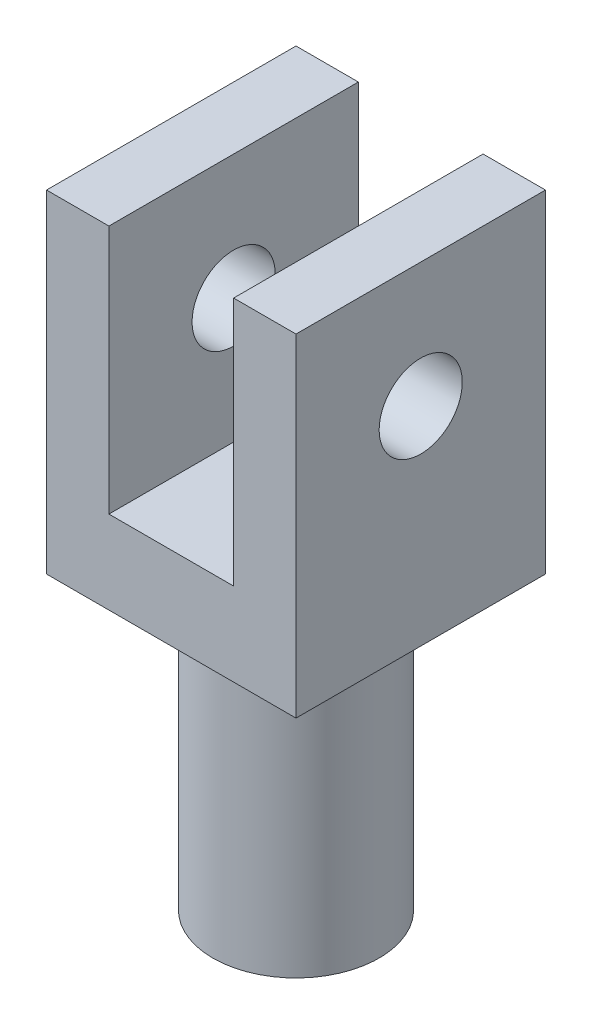
ISO-10303-21;
HEADER;
FILE_DESCRIPTION(('STEP AP214'),'2;1');
FILE_NAME('part.step','',(''),(''),'','','');
FILE_SCHEMA(('AUTOMOTIVE_DESIGN { 1 0 10303 214 1 1 1 1 }'));
ENDSEC;
DATA;
#1=APPLICATION_CONTEXT('core data for automotive mechanical design processes');
#2=APPLICATION_PROTOCOL_DEFINITION('international standard','automotive_design',2000,#1);
#3=PRODUCT_CONTEXT('',#1,'mechanical');
#4=PRODUCT('Part','Part','',(#3));
#5=PRODUCT_RELATED_PRODUCT_CATEGORY('part','',(#4));
#6=PRODUCT_DEFINITION_FORMATION('','',#4);
#7=PRODUCT_DEFINITION_CONTEXT('part definition',#1,'design');
#8=PRODUCT_DEFINITION('design','',#6,#7);
#9=PRODUCT_DEFINITION_SHAPE('','',#8);
#10=(LENGTH_UNIT() NAMED_UNIT(*) SI_UNIT(.MILLI.,.METRE.));
#11=(NAMED_UNIT(*) PLANE_ANGLE_UNIT() SI_UNIT($,.RADIAN.));
#12=(NAMED_UNIT(*) SI_UNIT($,.STERADIAN.) SOLID_ANGLE_UNIT());
#13=UNCERTAINTY_MEASURE_WITH_UNIT(LENGTH_MEASURE(1.E-05),#10,'distance_accuracy_value','');
#14=(GEOMETRIC_REPRESENTATION_CONTEXT(3) GLOBAL_UNCERTAINTY_ASSIGNED_CONTEXT((#13)) GLOBAL_UNIT_ASSIGNED_CONTEXT((#10,
#11,#12)) REPRESENTATION_CONTEXT('',''));
#15=CARTESIAN_POINT('',(0.,0.,0.));
#16=DIRECTION('',(0.,0.,1.));
#17=DIRECTION('',(1.,0.,0.));
#18=AXIS2_PLACEMENT_3D('',#15,#16,#17);
#19=CARTESIAN_POINT('',(0.,0.,30.));
#20=DIRECTION('',(0.,1.,0.));
#21=DIRECTION('',(0.,0.,1.));
#22=AXIS2_PLACEMENT_3D('',#19,#20,#21);
#23=PLANE('',#22);
#24=DIRECTION('',(1.,0.,0.));
#25=VECTOR('',#24,1.);
#26=CARTESIAN_POINT('',(0.,0.,0.));
#27=LINE('',#26,#25);
#28=CARTESIAN_POINT('',(-30.,0.,0.));
#29=VERTEX_POINT('',#28);
#30=CARTESIAN_POINT('',(0.,0.,0.));
#31=VERTEX_POINT('',#30);
#32=EDGE_CURVE('E78',#29,#31,#27,.T.);
#33=ORIENTED_EDGE('',*,*,#32,.T.);
#34=DIRECTION('',(0.,0.,-1.));
#35=VECTOR('',#34,1.);
#36=CARTESIAN_POINT('',(0.,0.,30.));
#37=LINE('',#36,#35);
#38=CARTESIAN_POINT('',(0.,0.,30.));
#39=VERTEX_POINT('',#38);
#40=EDGE_CURVE('E143',#39,#31,#37,.T.);
#41=ORIENTED_EDGE('',*,*,#40,.F.);
#42=DIRECTION('',(1.,0.,0.));
#43=VECTOR('',#42,1.);
#44=CARTESIAN_POINT('',(0.,0.,30.));
#45=LINE('',#44,#43);
#46=CARTESIAN_POINT('',(-30.,0.,30.));
#47=VERTEX_POINT('',#46);
#48=EDGE_CURVE('E57',#47,#39,#45,.T.);
#49=ORIENTED_EDGE('',*,*,#48,.F.);
#50=DIRECTION('',(0.,0.,-1.));
#51=VECTOR('',#50,1.);
#52=CARTESIAN_POINT('',(-30.,0.,30.));
#53=LINE('',#52,#51);
#54=EDGE_CURVE('E145',#47,#29,#53,.T.);
#55=ORIENTED_EDGE('',*,*,#54,.T.);
#56=EDGE_LOOP('',(#33,#41,#49,#55));
#57=FACE_BOUND('',#56,.T.);
#58=CARTESIAN_POINT('',(-15.,0.,15.));
#59=DIRECTION('',(0.,1.,0.));
#60=DIRECTION('',(0.,0.,1.));
#61=AXIS2_PLACEMENT_3D('',#58,#59,#60);
#62=CIRCLE('',#61,10.);
#63=CARTESIAN_POINT('',(-15.,0.,25.));
#64=VERTEX_POINT('',#63);
#65=EDGE_CURVE('E11',#64,#64,#62,.F.);
#66=ORIENTED_EDGE('',*,*,#65,.F.);
#67=EDGE_LOOP('',(#66));
#68=FACE_BOUND('',#67,.T.);
#69=ADVANCED_FACE('F33',(#57,#68),#23,.F.);
#70=CARTESIAN_POINT('',(0.,40.,30.));
#71=DIRECTION('',(0.,-1.,0.));
#72=DIRECTION('',(1.,0.,0.));
#73=AXIS2_PLACEMENT_3D('',#70,#71,#72);
#74=PLANE('',#73);
#75=DIRECTION('',(-1.,0.,0.));
#76=VECTOR('',#75,1.);
#77=CARTESIAN_POINT('',(0.,40.,0.));
#78=LINE('',#77,#76);
#79=CARTESIAN_POINT('',(0.,40.,0.));
#80=VERTEX_POINT('',#79);
#81=CARTESIAN_POINT('',(-7.5,40.,0.));
#82=VERTEX_POINT('',#81);
#83=EDGE_CURVE('E131',#80,#82,#78,.T.);
#84=ORIENTED_EDGE('',*,*,#83,.T.);
#85=DIRECTION('',(0.,0.,1.));
#86=VECTOR('',#85,1.);
#87=CARTESIAN_POINT('',(-7.5,40.,0.));
#88=LINE('',#87,#86);
#89=CARTESIAN_POINT('',(-7.5,40.,30.));
#90=VERTEX_POINT('',#89);
#91=EDGE_CURVE('E136',#82,#90,#88,.T.);
#92=ORIENTED_EDGE('',*,*,#91,.T.);
#93=DIRECTION('',(-1.,0.,0.));
#94=VECTOR('',#93,1.);
#95=CARTESIAN_POINT('',(0.,40.,30.));
#96=LINE('',#95,#94);
#97=CARTESIAN_POINT('',(0.,40.,30.));
#98=VERTEX_POINT('',#97);
#99=EDGE_CURVE('E86',#98,#90,#96,.T.);
#100=ORIENTED_EDGE('',*,*,#99,.F.);
#101=DIRECTION('',(0.,0.,-1.));
#102=VECTOR('',#101,1.);
#103=CARTESIAN_POINT('',(0.,40.,30.));
#104=LINE('',#103,#102);
#105=EDGE_CURVE('E41',#98,#80,#104,.T.);
#106=ORIENTED_EDGE('',*,*,#105,.T.);
#107=EDGE_LOOP('',(#84,#92,#100,#106));
#108=FACE_BOUND('',#107,.T.);
#109=ADVANCED_FACE('F199',(#108),#74,.F.);
#110=CARTESIAN_POINT('',(0.,0.,30.));
#111=DIRECTION('',(-1.,0.,0.));
#112=DIRECTION('',(0.,0.,1.));
#113=AXIS2_PLACEMENT_3D('',#110,#111,#112);
#114=PLANE('',#113);
#115=CARTESIAN_POINT('',(0.,25.,15.));
#116=DIRECTION('',(-1.,0.,0.));
#117=DIRECTION('',(0.,0.,1.));
#118=AXIS2_PLACEMENT_3D('',#115,#116,#117);
#119=CIRCLE('',#118,5.);
#120=CARTESIAN_POINT('',(0.,25.,20.));
#121=VERTEX_POINT('',#120);
#122=EDGE_CURVE('E156',#121,#121,#119,.T.);
#123=ORIENTED_EDGE('',*,*,#122,.T.);
#124=EDGE_LOOP('',(#123));
#125=FACE_BOUND('',#124,.T.);
#126=DIRECTION('',(0.,1.,0.));
#127=VECTOR('',#126,1.);
#128=CARTESIAN_POINT('',(0.,0.,0.));
#129=LINE('',#128,#127);
#130=EDGE_CURVE('E132',#31,#80,#129,.T.);
#131=ORIENTED_EDGE('',*,*,#130,.T.);
#132=ORIENTED_EDGE('',*,*,#105,.F.);
#133=DIRECTION('',(0.,1.,0.));
#134=VECTOR('',#133,1.);
#135=CARTESIAN_POINT('',(0.,0.,30.));
#136=LINE('',#135,#134);
#137=EDGE_CURVE('E142',#39,#98,#136,.T.);
#138=ORIENTED_EDGE('',*,*,#137,.F.);
#139=ORIENTED_EDGE('',*,*,#40,.T.);
#140=EDGE_LOOP('',(#131,#132,#138,#139));
#141=FACE_BOUND('',#140,.T.);
#142=ADVANCED_FACE('F35',(#125,#141),#114,.F.);
#143=CARTESIAN_POINT('',(-22.5,40.,30.));
#144=VERTEX_POINT('',#143);
#145=CARTESIAN_POINT('',(-30.,40.,30.));
#146=VERTEX_POINT('',#145);
#147=EDGE_CURVE('E125',#144,#146,#96,.T.);
#148=ORIENTED_EDGE('',*,*,#147,.F.);
#149=DIRECTION('',(0.,0.,1.));
#150=VECTOR('',#149,1.);
#151=CARTESIAN_POINT('',(-22.5,40.,0.));
#152=LINE('',#151,#150);
#153=CARTESIAN_POINT('',(-22.5,40.,0.));
#154=VERTEX_POINT('',#153);
#155=EDGE_CURVE('E112',#154,#144,#152,.T.);
#156=ORIENTED_EDGE('',*,*,#155,.F.);
#157=CARTESIAN_POINT('',(-30.,40.,0.));
#158=VERTEX_POINT('',#157);
#159=EDGE_CURVE('E123',#154,#158,#78,.T.);
#160=ORIENTED_EDGE('',*,*,#159,.T.);
#161=DIRECTION('',(0.,0.,-1.));
#162=VECTOR('',#161,1.);
#163=CARTESIAN_POINT('',(-30.,40.,30.));
#164=LINE('',#163,#162);
#165=EDGE_CURVE('E147',#146,#158,#164,.T.);
#166=ORIENTED_EDGE('',*,*,#165,.F.);
#167=EDGE_LOOP('',(#148,#156,#160,#166));
#168=FACE_BOUND('',#167,.T.);
#169=ADVANCED_FACE('F121',(#168),#74,.F.);
#170=CARTESIAN_POINT('',(-30.,0.,30.));
#171=DIRECTION('',(1.,0.,0.));
#172=DIRECTION('',(0.,0.,-1.));
#173=AXIS2_PLACEMENT_3D('',#170,#171,#172);
#174=PLANE('',#173);
#175=CARTESIAN_POINT('',(-30.,25.,15.));
#176=DIRECTION('',(-1.,0.,0.));
#177=DIRECTION('',(0.,0.,1.));
#178=AXIS2_PLACEMENT_3D('',#175,#176,#177);
#179=CIRCLE('',#178,5.);
#180=CARTESIAN_POINT('',(-30.,25.,20.));
#181=VERTEX_POINT('',#180);
#182=EDGE_CURVE('E152',#181,#181,#179,.T.);
#183=ORIENTED_EDGE('',*,*,#182,.F.);
#184=EDGE_LOOP('',(#183));
#185=FACE_BOUND('',#184,.T.);
#186=DIRECTION('',(0.,-1.,0.));
#187=VECTOR('',#186,1.);
#188=CARTESIAN_POINT('',(-30.,0.,0.));
#189=LINE('',#188,#187);
#190=EDGE_CURVE('E130',#158,#29,#189,.T.);
#191=ORIENTED_EDGE('',*,*,#190,.T.);
#192=ORIENTED_EDGE('',*,*,#54,.F.);
#193=DIRECTION('',(0.,-1.,0.));
#194=VECTOR('',#193,1.);
#195=CARTESIAN_POINT('',(-30.,0.,30.));
#196=LINE('',#195,#194);
#197=EDGE_CURVE('E183',#146,#47,#196,.T.);
#198=ORIENTED_EDGE('',*,*,#197,.F.);
#199=ORIENTED_EDGE('',*,*,#165,.T.);
#200=EDGE_LOOP('',(#191,#192,#198,#199));
#201=FACE_BOUND('',#200,.T.);
#202=ADVANCED_FACE('F189',(#185,#201),#174,.F.);
#203=CARTESIAN_POINT('',(0.,0.,30.));
#204=DIRECTION('',(0.,0.,1.));
#205=DIRECTION('',(1.,0.,0.));
#206=AXIS2_PLACEMENT_3D('',#203,#204,#205);
#207=PLANE('',#206);
#208=DIRECTION('',(0.,1.,0.));
#209=VECTOR('',#208,1.);
#210=CARTESIAN_POINT('',(-7.5,9.99999999999999,30.));
#211=LINE('',#210,#209);
#212=CARTESIAN_POINT('',(-7.5,9.99999999999999,30.));
#213=VERTEX_POINT('',#212);
#214=EDGE_CURVE('E117',#213,#90,#211,.T.);
#215=ORIENTED_EDGE('',*,*,#214,.F.);
#216=DIRECTION('',(1.,0.,0.));
#217=VECTOR('',#216,1.);
#218=CARTESIAN_POINT('',(-22.5,9.99999999999999,30.));
#219=LINE('',#218,#217);
#220=CARTESIAN_POINT('',(-22.5,9.99999999999999,30.));
#221=VERTEX_POINT('',#220);
#222=EDGE_CURVE('E173',#221,#213,#219,.T.);
#223=ORIENTED_EDGE('',*,*,#222,.F.);
#224=DIRECTION('',(0.,-1.,0.));
#225=VECTOR('',#224,1.);
#226=CARTESIAN_POINT('',(-22.5,40.,30.));
#227=LINE('',#226,#225);
#228=EDGE_CURVE('E167',#144,#221,#227,.T.);
#229=ORIENTED_EDGE('',*,*,#228,.F.);
#230=ORIENTED_EDGE('',*,*,#147,.T.);
#231=ORIENTED_EDGE('',*,*,#197,.T.);
#232=ORIENTED_EDGE('',*,*,#48,.T.);
#233=ORIENTED_EDGE('',*,*,#137,.T.);
#234=ORIENTED_EDGE('',*,*,#99,.T.);
#235=EDGE_LOOP('',(#215,#223,#229,#230,#231,#232,#233,#234));
#236=FACE_BOUND('',#235,.T.);
#237=ADVANCED_FACE('F187',(#236),#207,.T.);
#238=CARTESIAN_POINT('',(0.,0.,0.));
#239=DIRECTION('',(0.,0.,1.));
#240=DIRECTION('',(1.,0.,0.));
#241=AXIS2_PLACEMENT_3D('',#238,#239,#240);
#242=PLANE('',#241);
#243=DIRECTION('',(1.,0.,0.));
#244=VECTOR('',#243,1.);
#245=CARTESIAN_POINT('',(-22.5,9.99999999999999,0.));
#246=LINE('',#245,#244);
#247=CARTESIAN_POINT('',(-22.5,9.99999999999999,0.));
#248=VERTEX_POINT('',#247);
#249=CARTESIAN_POINT('',(-7.5,9.99999999999999,0.));
#250=VERTEX_POINT('',#249);
#251=EDGE_CURVE('E48',#248,#250,#246,.T.);
#252=ORIENTED_EDGE('',*,*,#251,.T.);
#253=DIRECTION('',(0.,1.,0.));
#254=VECTOR('',#253,1.);
#255=CARTESIAN_POINT('',(-7.5,9.99999999999999,0.));
#256=LINE('',#255,#254);
#257=EDGE_CURVE('E126',#250,#82,#256,.T.);
#258=ORIENTED_EDGE('',*,*,#257,.T.);
#259=ORIENTED_EDGE('',*,*,#83,.F.);
#260=ORIENTED_EDGE('',*,*,#130,.F.);
#261=ORIENTED_EDGE('',*,*,#32,.F.);
#262=ORIENTED_EDGE('',*,*,#190,.F.);
#263=ORIENTED_EDGE('',*,*,#159,.F.);
#264=DIRECTION('',(0.,-1.,0.));
#265=VECTOR('',#264,1.);
#266=CARTESIAN_POINT('',(-22.5,40.,0.));
#267=LINE('',#266,#265);
#268=EDGE_CURVE('E108',#154,#248,#267,.T.);
#269=ORIENTED_EDGE('',*,*,#268,.T.);
#270=EDGE_LOOP('',(#252,#258,#259,#260,#261,#262,#263,#269));
#271=FACE_BOUND('',#270,.T.);
#272=ADVANCED_FACE('F129',(#271),#242,.F.);
#273=CARTESIAN_POINT('',(-7.5,9.99999999999999,0.));
#274=DIRECTION('',(1.,0.,0.));
#275=DIRECTION('',(0.,0.,-1.));
#276=AXIS2_PLACEMENT_3D('',#273,#274,#275);
#277=PLANE('',#276);
#278=CARTESIAN_POINT('',(-7.5,25.,15.));
#279=DIRECTION('',(1.,0.,0.));
#280=DIRECTION('',(0.,0.,-1.));
#281=AXIS2_PLACEMENT_3D('',#278,#279,#280);
#282=CIRCLE('',#281,5.);
#283=CARTESIAN_POINT('',(-7.5,25.,10.));
#284=VERTEX_POINT('',#283);
#285=EDGE_CURVE('E151',#284,#284,#282,.T.);
#286=ORIENTED_EDGE('',*,*,#285,.T.);
#287=EDGE_LOOP('',(#286));
#288=FACE_BOUND('',#287,.T.);
#289=ORIENTED_EDGE('',*,*,#214,.T.);
#290=ORIENTED_EDGE('',*,*,#91,.F.);
#291=ORIENTED_EDGE('',*,*,#257,.F.);
#292=DIRECTION('',(0.,0.,1.));
#293=VECTOR('',#292,1.);
#294=CARTESIAN_POINT('',(-7.5,9.99999999999999,0.));
#295=LINE('',#294,#293);
#296=EDGE_CURVE('E178',#250,#213,#295,.T.);
#297=ORIENTED_EDGE('',*,*,#296,.T.);
#298=EDGE_LOOP('',(#289,#290,#291,#297));
#299=FACE_BOUND('',#298,.T.);
#300=ADVANCED_FACE('F197',(#288,#299),#277,.F.);
#301=CARTESIAN_POINT('',(-22.5,9.99999999999999,0.));
#302=DIRECTION('',(0.,-1.,0.));
#303=DIRECTION('',(0.,0.,-1.));
#304=AXIS2_PLACEMENT_3D('',#301,#302,#303);
#305=PLANE('',#304);
#306=ORIENTED_EDGE('',*,*,#222,.T.);
#307=ORIENTED_EDGE('',*,*,#296,.F.);
#308=ORIENTED_EDGE('',*,*,#251,.F.);
#309=DIRECTION('',(0.,0.,1.));
#310=VECTOR('',#309,1.);
#311=CARTESIAN_POINT('',(-22.5,9.99999999999999,0.));
#312=LINE('',#311,#310);
#313=EDGE_CURVE('E114',#248,#221,#312,.T.);
#314=ORIENTED_EDGE('',*,*,#313,.T.);
#315=EDGE_LOOP('',(#306,#307,#308,#314));
#316=FACE_BOUND('',#315,.T.);
#317=ADVANCED_FACE('F223',(#316),#305,.F.);
#318=CARTESIAN_POINT('',(-22.5,40.,0.));
#319=DIRECTION('',(-1.,0.,0.));
#320=DIRECTION('',(0.,-1.,0.));
#321=AXIS2_PLACEMENT_3D('',#318,#319,#320);
#322=PLANE('',#321);
#323=CARTESIAN_POINT('',(-22.5,25.,15.));
#324=DIRECTION('',(-1.,0.,0.));
#325=DIRECTION('',(0.,-1.,0.));
#326=AXIS2_PLACEMENT_3D('',#323,#324,#325);
#327=CIRCLE('',#326,5.);
#328=CARTESIAN_POINT('',(-22.5,20.,15.));
#329=VERTEX_POINT('',#328);
#330=EDGE_CURVE('E149',#329,#329,#327,.T.);
#331=ORIENTED_EDGE('',*,*,#330,.T.);
#332=EDGE_LOOP('',(#331));
#333=FACE_BOUND('',#332,.T.);
#334=ORIENTED_EDGE('',*,*,#228,.T.);
#335=ORIENTED_EDGE('',*,*,#313,.F.);
#336=ORIENTED_EDGE('',*,*,#268,.F.);
#337=ORIENTED_EDGE('',*,*,#155,.T.);
#338=EDGE_LOOP('',(#334,#335,#336,#337));
#339=FACE_BOUND('',#338,.T.);
#340=ADVANCED_FACE('F111',(#333,#339),#322,.F.);
#341=CARTESIAN_POINT('',(20.,25.,15.));
#342=DIRECTION('',(-1.,0.,0.));
#343=DIRECTION('',(0.,0.,1.));
#344=AXIS2_PLACEMENT_3D('',#341,#342,#343);
#345=CYLINDRICAL_SURFACE('',#344,5.);
#346=ORIENTED_EDGE('',*,*,#182,.T.);
#347=EDGE_LOOP('',(#346));
#348=FACE_BOUND('',#347,.T.);
#349=ORIENTED_EDGE('',*,*,#330,.F.);
#350=EDGE_LOOP('',(#349));
#351=FACE_BOUND('',#350,.T.);
#352=ADVANCED_FACE('F222',(#348,#351),#345,.F.);
#353=ORIENTED_EDGE('',*,*,#285,.F.);
#354=EDGE_LOOP('',(#353));
#355=FACE_BOUND('',#354,.T.);
#356=ORIENTED_EDGE('',*,*,#122,.F.);
#357=EDGE_LOOP('',(#356));
#358=FACE_BOUND('',#357,.T.);
#359=ADVANCED_FACE('F229',(#355,#358),#345,.F.);
#360=CARTESIAN_POINT('',(-15.,-35.,15.));
#361=DIRECTION('',(0.,1.,0.));
#362=DIRECTION('',(0.,0.,1.));
#363=AXIS2_PLACEMENT_3D('',#360,#361,#362);
#364=CYLINDRICAL_SURFACE('',#363,10.);
#365=CARTESIAN_POINT('',(-15.,-35.,15.));
#366=DIRECTION('',(0.,-1.,0.));
#367=DIRECTION('',(0.,0.,-1.));
#368=AXIS2_PLACEMENT_3D('',#365,#366,#367);
#369=CIRCLE('',#368,10.);
#370=CARTESIAN_POINT('',(-15.,-35.,4.99999999999999));
#371=VERTEX_POINT('',#370);
#372=EDGE_CURVE('E159',#371,#371,#369,.T.);
#373=ORIENTED_EDGE('',*,*,#372,.F.);
#374=EDGE_LOOP('',(#373));
#375=FACE_BOUND('',#374,.T.);
#376=ORIENTED_EDGE('',*,*,#65,.T.);
#377=EDGE_LOOP('',(#376));
#378=FACE_BOUND('',#377,.T.);
#379=ADVANCED_FACE('F232',(#375,#378),#364,.T.);
#380=CARTESIAN_POINT('',(-15.,-35.,15.));
#381=DIRECTION('',(0.,-1.,0.));
#382=DIRECTION('',(0.,0.,-1.));
#383=AXIS2_PLACEMENT_3D('',#380,#381,#382);
#384=PLANE('',#383);
#385=ORIENTED_EDGE('',*,*,#372,.T.);
#386=EDGE_LOOP('',(#385));
#387=FACE_BOUND('',#386,.T.);
#388=ADVANCED_FACE('F236',(#387),#384,.T.);
#389=CLOSED_SHELL('',(#69,#109,#142,#169,#202,#237,#272,#300,#317,#340,#352,#359,#379,#388));
#390=MANIFOLD_SOLID_BREP('B2',#389);
#391=ADVANCED_BREP_SHAPE_REPRESENTATION('',(#18,#390),#14);
#392=SHAPE_DEFINITION_REPRESENTATION(#9,#391);
ENDSEC;
END-ISO-10303-21;
